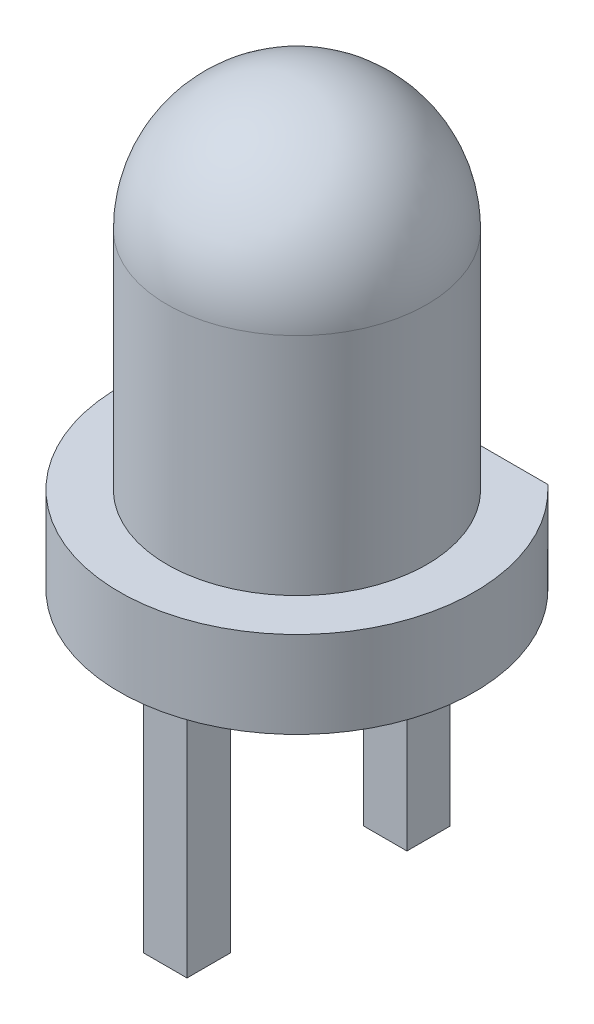
ISO-10303-21;
HEADER;
FILE_DESCRIPTION(('STEP AP214'),'2;1');
FILE_NAME('part.step','',(''),(''),'','','');
FILE_SCHEMA(('AUTOMOTIVE_DESIGN { 1 0 10303 214 1 1 1 1 }'));
ENDSEC;
DATA;
#1=APPLICATION_CONTEXT('core data for automotive mechanical design processes');
#2=APPLICATION_PROTOCOL_DEFINITION('international standard','automotive_design',2000,#1);
#3=PRODUCT_CONTEXT('',#1,'mechanical');
#4=PRODUCT('Part','Part','',(#3));
#5=PRODUCT_RELATED_PRODUCT_CATEGORY('part','',(#4));
#6=PRODUCT_DEFINITION_FORMATION('','',#4);
#7=PRODUCT_DEFINITION_CONTEXT('part definition',#1,'design');
#8=PRODUCT_DEFINITION('design','',#6,#7);
#9=PRODUCT_DEFINITION_SHAPE('','',#8);
#10=(LENGTH_UNIT() NAMED_UNIT(*) SI_UNIT(.MILLI.,.METRE.));
#11=(NAMED_UNIT(*) PLANE_ANGLE_UNIT() SI_UNIT($,.RADIAN.));
#12=(NAMED_UNIT(*) SI_UNIT($,.STERADIAN.) SOLID_ANGLE_UNIT());
#13=UNCERTAINTY_MEASURE_WITH_UNIT(LENGTH_MEASURE(1.E-05),#10,'distance_accuracy_value','');
#14=(GEOMETRIC_REPRESENTATION_CONTEXT(3) GLOBAL_UNCERTAINTY_ASSIGNED_CONTEXT((#13)) GLOBAL_UNIT_ASSIGNED_CONTEXT((#10,
#11,#12)) REPRESENTATION_CONTEXT('',''));
#15=CARTESIAN_POINT('',(0.,0.,0.));
#16=DIRECTION('',(0.,0.,1.));
#17=DIRECTION('',(1.,0.,0.));
#18=AXIS2_PLACEMENT_3D('',#15,#16,#17);
#19=CARTESIAN_POINT('',(-2.05000000000002,-1.,0.));
#20=DIRECTION('',(0.,-1.,0.));
#21=DIRECTION('',(0.999999999999999,0.,0.));
#22=AXIS2_PLACEMENT_3D('',#19,#20,#21);
#23=PLANE('',#22);
#24=DIRECTION('',(-0.999999999999999,0.,0.));
#25=VECTOR('',#24,1.);
#26=CARTESIAN_POINT('',(-0.250000000000014,-0.999999999999997,1.52000000000001));
#27=LINE('',#26,#25);
#28=CARTESIAN_POINT('',(0.249999999999986,-0.999999999999987,1.52000000000003));
#29=VERTEX_POINT('',#28);
#30=CARTESIAN_POINT('',(-0.250000000000014,-0.999999999999997,1.52000000000001));
#31=VERTEX_POINT('',#30);
#32=EDGE_CURVE('E165',#29,#31,#27,.T.);
#33=ORIENTED_EDGE('',*,*,#32,.F.);
#34=DIRECTION('',(0.,0.,1.));
#35=VECTOR('',#34,1.);
#36=CARTESIAN_POINT('',(0.249999999999986,-1.,1.01999999999999));
#37=LINE('',#36,#35);
#38=CARTESIAN_POINT('',(0.249999999999986,-1.,1.01999999999999));
#39=VERTEX_POINT('',#38);
#40=EDGE_CURVE('E162',#39,#29,#37,.T.);
#41=ORIENTED_EDGE('',*,*,#40,.F.);
#42=DIRECTION('',(0.999999999999999,0.,0.));
#43=VECTOR('',#42,1.);
#44=CARTESIAN_POINT('',(-0.250000000000014,-1.,1.01999999999999));
#45=LINE('',#44,#43);
#46=CARTESIAN_POINT('',(-0.250000000000014,-1.,1.01999999999999));
#47=VERTEX_POINT('',#46);
#48=EDGE_CURVE('E175',#47,#39,#45,.T.);
#49=ORIENTED_EDGE('',*,*,#48,.F.);
#50=DIRECTION('',(0.,0.,-0.999999999999999));
#51=VECTOR('',#50,1.);
#52=CARTESIAN_POINT('',(-0.250000000000014,-1.,1.01999999999999));
#53=LINE('',#52,#51);
#54=EDGE_CURVE('E183',#31,#47,#53,.T.);
#55=ORIENTED_EDGE('',*,*,#54,.F.);
#56=EDGE_LOOP('',(#33,#41,#49,#55));
#57=FACE_BOUND('',#56,.T.);
#58=DIRECTION('',(-0.999999999999999,0.,0.));
#59=VECTOR('',#58,1.);
#60=CARTESIAN_POINT('',(-0.25,-0.999999999999994,-1.02));
#61=LINE('',#60,#59);
#62=CARTESIAN_POINT('',(0.25,-1.,-1.02000000000001));
#63=VERTEX_POINT('',#62);
#64=CARTESIAN_POINT('',(-0.25,-0.999999999999994,-1.02));
#65=VERTEX_POINT('',#64);
#66=EDGE_CURVE('E226',#63,#65,#61,.T.);
#67=ORIENTED_EDGE('',*,*,#66,.F.);
#68=DIRECTION('',(0.,0.,0.999999999999999));
#69=VECTOR('',#68,1.);
#70=CARTESIAN_POINT('',(0.249999999999986,-1.,-1.51999999999999));
#71=LINE('',#70,#69);
#72=CARTESIAN_POINT('',(0.25,-1.,-1.50000000000001));
#73=VERTEX_POINT('',#72);
#74=EDGE_CURVE('E161',#73,#63,#71,.T.);
#75=ORIENTED_EDGE('',*,*,#74,.F.);
#76=DIRECTION('',(-1.,0.,0.));
#77=VECTOR('',#76,1.);
#78=CARTESIAN_POINT('',(-2.05000000000004,-1.00000000000001,-1.50000000000001));
#79=LINE('',#78,#77);
#80=CARTESIAN_POINT('',(1.39731886124821,-0.999999999999997,-1.49999999999999));
#81=VERTEX_POINT('',#80);
#82=EDGE_CURVE('E13',#81,#73,#79,.T.);
#83=ORIENTED_EDGE('',*,*,#82,.F.);
#84=CARTESIAN_POINT('',(0.,-1.00000000000001,0.));
#85=DIRECTION('',(0.,1.,0.));
#86=DIRECTION('',(-0.999999999999999,0.,0.));
#87=AXIS2_PLACEMENT_3D('',#84,#85,#86);
#88=CIRCLE('',#87,2.05);
#89=CARTESIAN_POINT('',(-1.39731886124819,-1.00000000000001,-1.49999999999997));
#90=VERTEX_POINT('',#89);
#91=EDGE_CURVE('E201',#90,#81,#88,.T.);
#92=ORIENTED_EDGE('',*,*,#91,.F.);
#93=CARTESIAN_POINT('',(-0.25,-1.,-1.49999999999999));
#94=VERTEX_POINT('',#93);
#95=EDGE_CURVE('E57',#94,#90,#79,.T.);
#96=ORIENTED_EDGE('',*,*,#95,.F.);
#97=DIRECTION('',(0.,0.,-0.999999999999999));
#98=VECTOR('',#97,1.);
#99=CARTESIAN_POINT('',(-0.250000000000014,-1.,-1.52));
#100=LINE('',#99,#98);
#101=EDGE_CURVE('E64',#65,#94,#100,.T.);
#102=ORIENTED_EDGE('',*,*,#101,.F.);
#103=EDGE_LOOP('',(#67,#75,#83,#92,#96,#102));
#104=FACE_BOUND('',#103,.T.);
#105=ADVANCED_FACE('F48',(#57,#104),#23,.T.);
#106=CARTESIAN_POINT('',(0.,2.59999999999999,0.));
#107=DIRECTION('',(0.,1.,0.));
#108=DIRECTION('',(-0.999999999999999,0.,0.));
#109=AXIS2_PLACEMENT_3D('',#106,#107,#108);
#110=SPHERICAL_SURFACE('',#109,1.5);
#111=CARTESIAN_POINT('',(0.,2.59999999999999,0.));
#112=DIRECTION('',(0.,1.,0.));
#113=DIRECTION('',(-0.999999999999999,0.,0.));
#114=AXIS2_PLACEMENT_3D('',#111,#112,#113);
#115=CIRCLE('',#114,1.5);
#116=CARTESIAN_POINT('',(-1.5,2.59999999999999,0.));
#117=VERTEX_POINT('',#116);
#118=EDGE_CURVE('E209',#117,#117,#115,.T.);
#119=ORIENTED_EDGE('',*,*,#118,.T.);
#120=EDGE_LOOP('',(#119));
#121=FACE_BOUND('',#120,.T.);
#122=ADVANCED_FACE('F50',(#121),#110,.T.);
#123=CARTESIAN_POINT('',(0.,4.09999999999999,0.));
#124=DIRECTION('',(0.,1.,0.));
#125=DIRECTION('',(-0.999999999999999,0.,0.));
#126=AXIS2_PLACEMENT_3D('',#123,#124,#125);
#127=CYLINDRICAL_SURFACE('',#126,1.5);
#128=CARTESIAN_POINT('',(0.,0.,0.));
#129=DIRECTION('',(0.,1.,0.));
#130=DIRECTION('',(-0.999999999999999,0.,0.));
#131=AXIS2_PLACEMENT_3D('',#128,#129,#130);
#132=CIRCLE('',#131,1.5);
#133=CARTESIAN_POINT('',(0.,0.,-1.49999999999999));
#134=VERTEX_POINT('',#133);
#135=EDGE_CURVE('E207',#134,#134,#132,.T.);
#136=ORIENTED_EDGE('',*,*,#135,.T.);
#137=EDGE_LOOP('',(#136));
#138=FACE_BOUND('',#137,.T.);
#139=ORIENTED_EDGE('',*,*,#118,.F.);
#140=EDGE_LOOP('',(#139));
#141=FACE_BOUND('',#140,.T.);
#142=ADVANCED_FACE('F251',(#138,#141),#127,.T.);
#143=CARTESIAN_POINT('',(-1.49999999999999,0.,0.));
#144=DIRECTION('',(0.,1.,0.));
#145=DIRECTION('',(-0.999999999999999,0.,0.));
#146=AXIS2_PLACEMENT_3D('',#143,#144,#145);
#147=PLANE('',#146);
#148=DIRECTION('',(1.,0.,0.));
#149=VECTOR('',#148,1.);
#150=CARTESIAN_POINT('',(-1.94940332585723,0.,-1.49999999999998));
#151=LINE('',#150,#149);
#152=CARTESIAN_POINT('',(-1.39731886124823,0.,-1.49999999999999));
#153=VERTEX_POINT('',#152);
#154=EDGE_CURVE('E196',#153,#134,#151,.T.);
#155=ORIENTED_EDGE('',*,*,#154,.F.);
#156=CARTESIAN_POINT('',(0.,0.,0.));
#157=DIRECTION('',(0.,1.,0.));
#158=DIRECTION('',(-0.999999999999999,0.,0.));
#159=AXIS2_PLACEMENT_3D('',#156,#157,#158);
#160=CIRCLE('',#159,2.05);
#161=CARTESIAN_POINT('',(1.39731886124819,0.,-1.5));
#162=VERTEX_POINT('',#161);
#163=EDGE_CURVE('E204',#153,#162,#160,.T.);
#164=ORIENTED_EDGE('',*,*,#163,.T.);
#165=EDGE_CURVE('E194',#134,#162,#151,.T.);
#166=ORIENTED_EDGE('',*,*,#165,.F.);
#167=ORIENTED_EDGE('',*,*,#135,.F.);
#168=EDGE_LOOP('',(#155,#164,#166,#167));
#169=FACE_BOUND('',#168,.T.);
#170=ADVANCED_FACE('F249',(#169),#147,.T.);
#171=CARTESIAN_POINT('',(0.,4.09999999999999,0.));
#172=DIRECTION('',(0.,1.,0.));
#173=DIRECTION('',(-0.999999999999999,0.,0.));
#174=AXIS2_PLACEMENT_3D('',#171,#172,#173);
#175=CYLINDRICAL_SURFACE('',#174,2.05);
#176=DIRECTION('',(0.,1.,0.));
#177=VECTOR('',#176,1.);
#178=CARTESIAN_POINT('',(1.39731886124818,4.09999999999999,-1.50000000000004));
#179=LINE('',#178,#177);
#180=EDGE_CURVE('E199',#162,#81,#179,.F.);
#181=ORIENTED_EDGE('',*,*,#180,.F.);
#182=ORIENTED_EDGE('',*,*,#163,.F.);
#183=DIRECTION('',(0.,1.,0.));
#184=VECTOR('',#183,1.);
#185=CARTESIAN_POINT('',(-1.39731886124823,4.1,-1.49999999999997));
#186=LINE('',#185,#184);
#187=EDGE_CURVE('E197',#90,#153,#186,.T.);
#188=ORIENTED_EDGE('',*,*,#187,.F.);
#189=ORIENTED_EDGE('',*,*,#91,.T.);
#190=EDGE_LOOP('',(#181,#182,#188,#189));
#191=FACE_BOUND('',#190,.T.);
#192=ADVANCED_FACE('F243',(#191),#175,.T.);
#193=CARTESIAN_POINT('',(-1.94940332585723,-0.999999999999997,-1.50000000000001));
#194=DIRECTION('',(0.,0.,1.));
#195=DIRECTION('',(1.,0.,0.));
#196=AXIS2_PLACEMENT_3D('',#193,#194,#195);
#197=PLANE('',#196);
#198=ORIENTED_EDGE('',*,*,#180,.T.);
#199=ORIENTED_EDGE('',*,*,#82,.T.);
#200=EDGE_CURVE('E56',#73,#94,#79,.T.);
#201=ORIENTED_EDGE('',*,*,#200,.T.);
#202=ORIENTED_EDGE('',*,*,#95,.T.);
#203=ORIENTED_EDGE('',*,*,#187,.T.);
#204=ORIENTED_EDGE('',*,*,#154,.T.);
#205=ORIENTED_EDGE('',*,*,#165,.T.);
#206=EDGE_LOOP('',(#198,#199,#201,#202,#203,#204,#205));
#207=FACE_BOUND('',#206,.T.);
#208=ADVANCED_FACE('F217',(#207),#197,.F.);
#209=CARTESIAN_POINT('',(0.249999999999986,-4.,1.02000000000001));
#210=DIRECTION('',(-1.,0.,0.));
#211=DIRECTION('',(0.,-1.,0.));
#212=AXIS2_PLACEMENT_3D('',#209,#210,#211);
#213=PLANE('',#212);
#214=ORIENTED_EDGE('',*,*,#40,.T.);
#215=DIRECTION('',(0.,1.,0.));
#216=VECTOR('',#215,1.);
#217=CARTESIAN_POINT('',(0.249999999999972,-4.00000000000001,1.52000000000001));
#218=LINE('',#217,#216);
#219=CARTESIAN_POINT('',(0.249999999999972,-4.00000000000001,1.52000000000001));
#220=VERTEX_POINT('',#219);
#221=EDGE_CURVE('E192',#220,#29,#218,.T.);
#222=ORIENTED_EDGE('',*,*,#221,.F.);
#223=DIRECTION('',(0.,0.,1.));
#224=VECTOR('',#223,1.);
#225=CARTESIAN_POINT('',(0.249999999999986,-4.,1.02000000000001));
#226=LINE('',#225,#224);
#227=CARTESIAN_POINT('',(0.249999999999986,-4.,1.02000000000001));
#228=VERTEX_POINT('',#227);
#229=EDGE_CURVE('E171',#228,#220,#226,.T.);
#230=ORIENTED_EDGE('',*,*,#229,.F.);
#231=DIRECTION('',(0.,1.,0.));
#232=VECTOR('',#231,1.);
#233=CARTESIAN_POINT('',(0.249999999999986,-4.,1.02000000000001));
#234=LINE('',#233,#232);
#235=EDGE_CURVE('E180',#228,#39,#234,.T.);
#236=ORIENTED_EDGE('',*,*,#235,.T.);
#237=EDGE_LOOP('',(#214,#222,#230,#236));
#238=FACE_BOUND('',#237,.T.);
#239=ADVANCED_FACE('F272',(#238),#213,.F.);
#240=CARTESIAN_POINT('',(-0.250000000000014,-3.99999999999999,1.52));
#241=DIRECTION('',(0.,0.,-0.999999999999999));
#242=DIRECTION('',(-0.999999999999999,0.,0.));
#243=AXIS2_PLACEMENT_3D('',#240,#241,#242);
#244=PLANE('',#243);
#245=ORIENTED_EDGE('',*,*,#32,.T.);
#246=DIRECTION('',(0.,1.,0.));
#247=VECTOR('',#246,1.);
#248=CARTESIAN_POINT('',(-0.250000000000014,-3.99999999999999,1.52));
#249=LINE('',#248,#247);
#250=CARTESIAN_POINT('',(-0.250000000000014,-3.99999999999999,1.52));
#251=VERTEX_POINT('',#250);
#252=EDGE_CURVE('E189',#251,#31,#249,.T.);
#253=ORIENTED_EDGE('',*,*,#252,.F.);
#254=DIRECTION('',(-0.999999999999999,0.,0.));
#255=VECTOR('',#254,1.);
#256=CARTESIAN_POINT('',(-0.250000000000014,-3.99999999999999,1.52));
#257=LINE('',#256,#255);
#258=EDGE_CURVE('E174',#220,#251,#257,.T.);
#259=ORIENTED_EDGE('',*,*,#258,.F.);
#260=ORIENTED_EDGE('',*,*,#221,.T.);
#261=EDGE_LOOP('',(#245,#253,#259,#260));
#262=FACE_BOUND('',#261,.T.);
#263=ADVANCED_FACE('F276',(#262),#244,.F.);
#264=CARTESIAN_POINT('',(-0.250000000000014,-3.99999999999999,1.02));
#265=DIRECTION('',(0.999999999999999,0.,0.));
#266=DIRECTION('',(0.,1.,0.));
#267=AXIS2_PLACEMENT_3D('',#264,#265,#266);
#268=PLANE('',#267);
#269=ORIENTED_EDGE('',*,*,#54,.T.);
#270=DIRECTION('',(0.,1.,0.));
#271=VECTOR('',#270,1.);
#272=CARTESIAN_POINT('',(-0.250000000000014,-3.99999999999999,1.02));
#273=LINE('',#272,#271);
#274=CARTESIAN_POINT('',(-0.250000000000014,-3.99999999999999,1.02));
#275=VERTEX_POINT('',#274);
#276=EDGE_CURVE('E72',#275,#47,#273,.T.);
#277=ORIENTED_EDGE('',*,*,#276,.F.);
#278=DIRECTION('',(0.,0.,-0.999999999999999));
#279=VECTOR('',#278,1.);
#280=CARTESIAN_POINT('',(-0.250000000000014,-3.99999999999999,1.02));
#281=LINE('',#280,#279);
#282=EDGE_CURVE('E177',#251,#275,#281,.T.);
#283=ORIENTED_EDGE('',*,*,#282,.F.);
#284=ORIENTED_EDGE('',*,*,#252,.T.);
#285=EDGE_LOOP('',(#269,#277,#283,#284));
#286=FACE_BOUND('',#285,.T.);
#287=ADVANCED_FACE('F281',(#286),#268,.F.);
#288=CARTESIAN_POINT('',(-0.250000000000014,-3.99999999999999,1.02));
#289=DIRECTION('',(0.,0.,0.999999999999999));
#290=DIRECTION('',(0.999999999999999,0.,0.));
#291=AXIS2_PLACEMENT_3D('',#288,#289,#290);
#292=PLANE('',#291);
#293=ORIENTED_EDGE('',*,*,#48,.T.);
#294=ORIENTED_EDGE('',*,*,#235,.F.);
#295=DIRECTION('',(0.999999999999999,0.,0.));
#296=VECTOR('',#295,1.);
#297=CARTESIAN_POINT('',(-0.250000000000014,-3.99999999999999,1.02));
#298=LINE('',#297,#296);
#299=EDGE_CURVE('E179',#275,#228,#298,.T.);
#300=ORIENTED_EDGE('',*,*,#299,.F.);
#301=ORIENTED_EDGE('',*,*,#276,.T.);
#302=EDGE_LOOP('',(#293,#294,#300,#301));
#303=FACE_BOUND('',#302,.T.);
#304=ADVANCED_FACE('F287',(#303),#292,.F.);
#305=CARTESIAN_POINT('',(0.,-4.,0.));
#306=DIRECTION('',(0.,1.,0.));
#307=DIRECTION('',(0.,0.,0.999999999999999));
#308=AXIS2_PLACEMENT_3D('',#305,#306,#307);
#309=PLANE('',#308);
#310=ORIENTED_EDGE('',*,*,#229,.T.);
#311=ORIENTED_EDGE('',*,*,#258,.T.);
#312=ORIENTED_EDGE('',*,*,#282,.T.);
#313=ORIENTED_EDGE('',*,*,#299,.T.);
#314=EDGE_LOOP('',(#310,#311,#312,#313));
#315=FACE_BOUND('',#314,.T.);
#316=ADVANCED_FACE('F291',(#315),#309,.F.);
#317=CARTESIAN_POINT('',(0.,-1.00000000000001,0.));
#318=DIRECTION('',(0.,1.,0.));
#319=DIRECTION('',(0.,0.,0.999999999999999));
#320=AXIS2_PLACEMENT_3D('',#317,#318,#319);
#321=PLANE('',#320);
#322=ORIENTED_EDGE('',*,*,#200,.F.);
#323=CARTESIAN_POINT('',(0.249999999999986,-1.,-1.51999999999999));
#324=VERTEX_POINT('',#323);
#325=EDGE_CURVE('E223',#324,#73,#71,.T.);
#326=ORIENTED_EDGE('',*,*,#325,.F.);
#327=DIRECTION('',(0.999999999999999,0.,0.));
#328=VECTOR('',#327,1.);
#329=CARTESIAN_POINT('',(-0.250000000000014,-1.,-1.52));
#330=LINE('',#329,#328);
#331=CARTESIAN_POINT('',(-0.250000000000014,-1.,-1.52));
#332=VERTEX_POINT('',#331);
#333=EDGE_CURVE('E156',#332,#324,#330,.T.);
#334=ORIENTED_EDGE('',*,*,#333,.F.);
#335=EDGE_CURVE('E224',#94,#332,#100,.T.);
#336=ORIENTED_EDGE('',*,*,#335,.F.);
#337=EDGE_LOOP('',(#322,#326,#334,#336));
#338=FACE_BOUND('',#337,.T.);
#339=ADVANCED_FACE('F221',(#338),#321,.T.);
#340=CARTESIAN_POINT('',(0.249999999999986,-3.99999999999999,-1.52000000000002));
#341=DIRECTION('',(-0.999999999999999,0.,0.));
#342=DIRECTION('',(0.,-1.,0.));
#343=AXIS2_PLACEMENT_3D('',#340,#341,#342);
#344=PLANE('',#343);
#345=ORIENTED_EDGE('',*,*,#325,.T.);
#346=ORIENTED_EDGE('',*,*,#74,.T.);
#347=DIRECTION('',(0.,1.,0.));
#348=VECTOR('',#347,1.);
#349=CARTESIAN_POINT('',(0.249999999999986,-4.00000000000001,-1.02000000000001));
#350=LINE('',#349,#348);
#351=CARTESIAN_POINT('',(0.249999999999986,-4.00000000000001,-1.02000000000001));
#352=VERTEX_POINT('',#351);
#353=EDGE_CURVE('E141',#352,#63,#350,.T.);
#354=ORIENTED_EDGE('',*,*,#353,.F.);
#355=DIRECTION('',(0.,0.,0.999999999999999));
#356=VECTOR('',#355,1.);
#357=CARTESIAN_POINT('',(0.249999999999986,-3.99999999999999,-1.52000000000002));
#358=LINE('',#357,#356);
#359=CARTESIAN_POINT('',(0.249999999999986,-3.99999999999999,-1.52000000000002));
#360=VERTEX_POINT('',#359);
#361=EDGE_CURVE('E147',#360,#352,#358,.T.);
#362=ORIENTED_EDGE('',*,*,#361,.F.);
#363=DIRECTION('',(0.,1.,0.));
#364=VECTOR('',#363,1.);
#365=CARTESIAN_POINT('',(0.249999999999986,-3.99999999999999,-1.52000000000002));
#366=LINE('',#365,#364);
#367=EDGE_CURVE('E225',#360,#324,#366,.T.);
#368=ORIENTED_EDGE('',*,*,#367,.T.);
#369=EDGE_LOOP('',(#345,#346,#354,#362,#368));
#370=FACE_BOUND('',#369,.T.);
#371=ADVANCED_FACE('F159',(#370),#344,.F.);
#372=CARTESIAN_POINT('',(-0.25,-3.99999999999999,-1.01999999999999));
#373=DIRECTION('',(0.,0.,-0.999999999999999));
#374=DIRECTION('',(-0.999999999999999,0.,0.));
#375=AXIS2_PLACEMENT_3D('',#372,#373,#374);
#376=PLANE('',#375);
#377=ORIENTED_EDGE('',*,*,#66,.T.);
#378=DIRECTION('',(0.,1.,0.));
#379=VECTOR('',#378,1.);
#380=CARTESIAN_POINT('',(-0.25,-3.99999999999999,-1.01999999999999));
#381=LINE('',#380,#379);
#382=CARTESIAN_POINT('',(-0.25,-3.99999999999999,-1.01999999999999));
#383=VERTEX_POINT('',#382);
#384=EDGE_CURVE('E143',#383,#65,#381,.T.);
#385=ORIENTED_EDGE('',*,*,#384,.F.);
#386=DIRECTION('',(-0.999999999999999,0.,0.));
#387=VECTOR('',#386,1.);
#388=CARTESIAN_POINT('',(-0.25,-3.99999999999999,-1.01999999999999));
#389=LINE('',#388,#387);
#390=EDGE_CURVE('E137',#352,#383,#389,.T.);
#391=ORIENTED_EDGE('',*,*,#390,.F.);
#392=ORIENTED_EDGE('',*,*,#353,.T.);
#393=EDGE_LOOP('',(#377,#385,#391,#392));
#394=FACE_BOUND('',#393,.T.);
#395=ADVANCED_FACE('F139',(#394),#376,.F.);
#396=CARTESIAN_POINT('',(-0.25,-4.00000000000001,-1.52000000000004));
#397=DIRECTION('',(0.999999999999999,0.,0.));
#398=DIRECTION('',(0.,1.,0.));
#399=AXIS2_PLACEMENT_3D('',#396,#397,#398);
#400=PLANE('',#399);
#401=ORIENTED_EDGE('',*,*,#101,.T.);
#402=ORIENTED_EDGE('',*,*,#335,.T.);
#403=DIRECTION('',(0.,1.,0.));
#404=VECTOR('',#403,1.);
#405=CARTESIAN_POINT('',(-0.25,-4.00000000000001,-1.52000000000004));
#406=LINE('',#405,#404);
#407=CARTESIAN_POINT('',(-0.25,-4.00000000000001,-1.52000000000004));
#408=VERTEX_POINT('',#407);
#409=EDGE_CURVE('E167',#408,#332,#406,.T.);
#410=ORIENTED_EDGE('',*,*,#409,.F.);
#411=DIRECTION('',(0.,0.,-0.999999999999999));
#412=VECTOR('',#411,1.);
#413=CARTESIAN_POINT('',(-0.25,-4.00000000000001,-1.52000000000004));
#414=LINE('',#413,#412);
#415=EDGE_CURVE('E146',#383,#408,#414,.T.);
#416=ORIENTED_EDGE('',*,*,#415,.F.);
#417=ORIENTED_EDGE('',*,*,#384,.T.);
#418=EDGE_LOOP('',(#401,#402,#410,#416,#417));
#419=FACE_BOUND('',#418,.T.);
#420=ADVANCED_FACE('F240',(#419),#400,.F.);
#421=CARTESIAN_POINT('',(-0.25,-4.00000000000001,-1.52000000000004));
#422=DIRECTION('',(0.,0.,0.999999999999999));
#423=DIRECTION('',(0.999999999999999,0.,0.));
#424=AXIS2_PLACEMENT_3D('',#421,#422,#423);
#425=PLANE('',#424);
#426=ORIENTED_EDGE('',*,*,#333,.T.);
#427=ORIENTED_EDGE('',*,*,#367,.F.);
#428=DIRECTION('',(0.999999999999999,0.,0.));
#429=VECTOR('',#428,1.);
#430=CARTESIAN_POINT('',(-0.25,-4.00000000000001,-1.52000000000004));
#431=LINE('',#430,#429);
#432=EDGE_CURVE('E152',#408,#360,#431,.T.);
#433=ORIENTED_EDGE('',*,*,#432,.F.);
#434=ORIENTED_EDGE('',*,*,#409,.T.);
#435=EDGE_LOOP('',(#426,#427,#433,#434));
#436=FACE_BOUND('',#435,.T.);
#437=ADVANCED_FACE('F239',(#436),#425,.F.);
#438=CARTESIAN_POINT('',(0.,-4.,0.));
#439=DIRECTION('',(0.,1.,0.));
#440=DIRECTION('',(0.,0.,0.999999999999999));
#441=AXIS2_PLACEMENT_3D('',#438,#439,#440);
#442=PLANE('',#441);
#443=ORIENTED_EDGE('',*,*,#361,.T.);
#444=ORIENTED_EDGE('',*,*,#390,.T.);
#445=ORIENTED_EDGE('',*,*,#415,.T.);
#446=ORIENTED_EDGE('',*,*,#432,.T.);
#447=EDGE_LOOP('',(#443,#444,#445,#446));
#448=FACE_BOUND('',#447,.T.);
#449=ADVANCED_FACE('F150',(#448),#442,.F.);
#450=CLOSED_SHELL('',(#105,#122,#142,#170,#192,#208,#239,#263,#287,#304,#316,#339,#371,#395,
#420,#437,#449));
#451=MANIFOLD_SOLID_BREP('B2',#450);
#452=ADVANCED_BREP_SHAPE_REPRESENTATION('',(#18,#451),#14);
#453=SHAPE_DEFINITION_REPRESENTATION(#9,#452);
ENDSEC;
END-ISO-10303-21;
